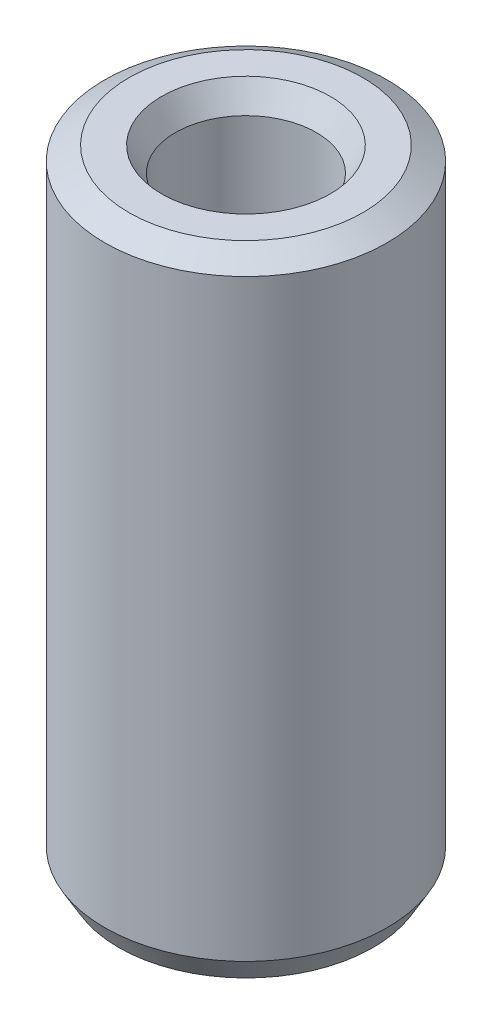
ISO-10303-21;
HEADER;
FILE_DESCRIPTION(('STEP AP214'),'2;1');
FILE_NAME('part.step','',(''),(''),'','','');
FILE_SCHEMA(('AUTOMOTIVE_DESIGN { 1 0 10303 214 1 1 1 1 }'));
ENDSEC;
DATA;
#1=APPLICATION_CONTEXT('core data for automotive mechanical design processes');
#2=APPLICATION_PROTOCOL_DEFINITION('international standard','automotive_design',2000,#1);
#3=PRODUCT_CONTEXT('',#1,'mechanical');
#4=PRODUCT('Part','Part','',(#3));
#5=PRODUCT_RELATED_PRODUCT_CATEGORY('part','',(#4));
#6=PRODUCT_DEFINITION_FORMATION('','',#4);
#7=PRODUCT_DEFINITION_CONTEXT('part definition',#1,'design');
#8=PRODUCT_DEFINITION('design','',#6,#7);
#9=PRODUCT_DEFINITION_SHAPE('','',#8);
#10=(LENGTH_UNIT() NAMED_UNIT(*) SI_UNIT(.MILLI.,.METRE.));
#11=(NAMED_UNIT(*) PLANE_ANGLE_UNIT() SI_UNIT($,.RADIAN.));
#12=(NAMED_UNIT(*) SI_UNIT($,.STERADIAN.) SOLID_ANGLE_UNIT());
#13=UNCERTAINTY_MEASURE_WITH_UNIT(LENGTH_MEASURE(1.E-05),#10,'distance_accuracy_value','');
#14=(GEOMETRIC_REPRESENTATION_CONTEXT(3) GLOBAL_UNCERTAINTY_ASSIGNED_CONTEXT((#13)) GLOBAL_UNIT_ASSIGNED_CONTEXT((#10,
#11,#12)) REPRESENTATION_CONTEXT('',''));
#15=CARTESIAN_POINT('',(0.,0.,0.));
#16=DIRECTION('',(0.,0.,1.));
#17=DIRECTION('',(1.,0.,0.));
#18=AXIS2_PLACEMENT_3D('',#15,#16,#17);
#19=CARTESIAN_POINT('',(0.,55.8873489757776,0.));
#20=DIRECTION('',(0.,-1.,0.));
#21=DIRECTION('',(0.,0.,-1.));
#22=AXIS2_PLACEMENT_3D('',#19,#20,#21);
#23=CYLINDRICAL_SURFACE('',#22,12.5);
#24=CARTESIAN_POINT('',(0.,2.14613170068918,0.));
#25=DIRECTION('',(0.,1.,0.));
#26=DIRECTION('',(0.,0.,1.));
#27=AXIS2_PLACEMENT_3D('',#24,#25,#26);
#28=CIRCLE('',#27,12.5);
#29=CARTESIAN_POINT('',(0.,2.14613170068918,12.5));
#30=VERTEX_POINT('',#29);
#31=EDGE_CURVE('E10',#30,#30,#28,.T.);
#32=ORIENTED_EDGE('',*,*,#31,.T.);
#33=EDGE_LOOP('',(#32));
#34=FACE_BOUND('',#33,.T.);
#35=CARTESIAN_POINT('',(0.,54.6482792606683,0.));
#36=DIRECTION('',(0.,1.,0.));
#37=DIRECTION('',(0.,0.,1.));
#38=AXIS2_PLACEMENT_3D('',#35,#36,#37);
#39=CIRCLE('',#38,12.5);
#40=CARTESIAN_POINT('',(0.,54.6482792606683,12.5));
#41=VERTEX_POINT('',#40);
#42=EDGE_CURVE('E50',#41,#41,#39,.F.);
#43=ORIENTED_EDGE('',*,*,#42,.T.);
#44=EDGE_LOOP('',(#43));
#45=FACE_BOUND('',#44,.T.);
#46=ADVANCED_FACE('F39',(#34,#45),#23,.T.);
#47=CARTESIAN_POINT('',(0.,55.8873489757776,0.));
#48=DIRECTION('',(0.,1.,0.));
#49=DIRECTION('',(0.,0.,1.));
#50=AXIS2_PLACEMENT_3D('',#47,#48,#49);
#51=PLANE('',#50);
#52=CARTESIAN_POINT('',(0.,55.8873489757776,0.));
#53=DIRECTION('',(0.,1.,0.));
#54=DIRECTION('',(0.,0.,1.));
#55=AXIS2_PLACEMENT_3D('',#52,#53,#54);
#56=CIRCLE('',#55,7.47347615860056);
#57=CARTESIAN_POINT('',(0.,55.8873489757776,7.47347615860056));
#58=VERTEX_POINT('',#57);
#59=EDGE_CURVE('E58',#58,#58,#56,.F.);
#60=ORIENTED_EDGE('',*,*,#59,.T.);
#61=EDGE_LOOP('',(#60));
#62=FACE_BOUND('',#61,.T.);
#63=CARTESIAN_POINT('',(0.,55.8873489757776,0.));
#64=DIRECTION('',(0.,1.,0.));
#65=DIRECTION('',(0.,0.,1.));
#66=AXIS2_PLACEMENT_3D('',#63,#64,#65);
#67=CIRCLE('',#66,10.3538682993108);
#68=CARTESIAN_POINT('',(0.,55.8873489757776,10.3538682993108));
#69=VERTEX_POINT('',#68);
#70=EDGE_CURVE('E61',#69,#69,#67,.T.);
#71=ORIENTED_EDGE('',*,*,#70,.T.);
#72=EDGE_LOOP('',(#71));
#73=FACE_BOUND('',#72,.T.);
#74=ADVANCED_FACE('F88',(#62,#73),#51,.T.);
#75=CARTESIAN_POINT('',(0.,0.,0.));
#76=DIRECTION('',(0.,1.,0.));
#77=DIRECTION('',(0.,0.,1.));
#78=AXIS2_PLACEMENT_3D('',#75,#76,#77);
#79=PLANE('',#78);
#80=CARTESIAN_POINT('',(0.,0.,0.));
#81=DIRECTION('',(0.,1.,0.));
#82=DIRECTION('',(0.,0.,1.));
#83=AXIS2_PLACEMENT_3D('',#80,#81,#82);
#84=CIRCLE('',#83,8.38053814418046);
#85=CARTESIAN_POINT('',(0.,0.,8.38053814418046));
#86=VERTEX_POINT('',#85);
#87=EDGE_CURVE('E51',#86,#86,#84,.T.);
#88=ORIENTED_EDGE('',*,*,#87,.T.);
#89=EDGE_LOOP('',(#88));
#90=FACE_BOUND('',#89,.T.);
#91=CARTESIAN_POINT('',(0.,0.,0.));
#92=DIRECTION('',(0.,1.,0.));
#93=DIRECTION('',(0.,0.,1.));
#94=AXIS2_PLACEMENT_3D('',#91,#92,#93);
#95=CIRCLE('',#94,11.2609302848907);
#96=CARTESIAN_POINT('',(0.,0.,11.2609302848907));
#97=VERTEX_POINT('',#96);
#98=EDGE_CURVE('E54',#97,#97,#95,.F.);
#99=ORIENTED_EDGE('',*,*,#98,.T.);
#100=EDGE_LOOP('',(#99));
#101=FACE_BOUND('',#100,.T.);
#102=ADVANCED_FACE('F83',(#90,#101),#79,.F.);
#103=CARTESIAN_POINT('',(0.,55.8873489757776,0.));
#104=DIRECTION('',(0.,-1.,0.));
#105=DIRECTION('',(0.,0.,-1.));
#106=AXIS2_PLACEMENT_3D('',#103,#104,#105);
#107=CYLINDRICAL_SURFACE('',#106,6.23440644349126);
#108=CARTESIAN_POINT('',(0.,53.7412172750884,0.));
#109=DIRECTION('',(0.,1.,0.));
#110=DIRECTION('',(0.,0.,1.));
#111=AXIS2_PLACEMENT_3D('',#108,#109,#110);
#112=CIRCLE('',#111,6.23440644349126);
#113=CARTESIAN_POINT('',(0.,53.7412172750884,6.23440644349126));
#114=VERTEX_POINT('',#113);
#115=EDGE_CURVE('E67',#114,#114,#112,.T.);
#116=ORIENTED_EDGE('',*,*,#115,.T.);
#117=EDGE_LOOP('',(#116));
#118=FACE_BOUND('',#117,.T.);
#119=CARTESIAN_POINT('',(0.,1.23906971510931,0.));
#120=DIRECTION('',(0.,1.,0.));
#121=DIRECTION('',(0.,0.,1.));
#122=AXIS2_PLACEMENT_3D('',#119,#120,#121);
#123=CIRCLE('',#122,6.23440644349126);
#124=CARTESIAN_POINT('',(0.,1.23906971510931,6.23440644349126));
#125=VERTEX_POINT('',#124);
#126=EDGE_CURVE('E69',#125,#125,#123,.F.);
#127=ORIENTED_EDGE('',*,*,#126,.T.);
#128=EDGE_LOOP('',(#127));
#129=FACE_BOUND('',#128,.T.);
#130=ADVANCED_FACE('F71',(#118,#129),#107,.F.);
#131=CARTESIAN_POINT('',(0.,53.7412172750884,0.));
#132=DIRECTION('',(0.,1.,0.));
#133=DIRECTION('',(0.,0.,1.));
#134=AXIS2_PLACEMENT_3D('',#131,#132,#133);
#135=CONICAL_SURFACE('',#134,6.23440644349126,0.523598775598302);
#136=ORIENTED_EDGE('',*,*,#59,.F.);
#137=EDGE_LOOP('',(#136));
#138=FACE_BOUND('',#137,.T.);
#139=ORIENTED_EDGE('',*,*,#115,.F.);
#140=EDGE_LOOP('',(#139));
#141=FACE_BOUND('',#140,.T.);
#142=ADVANCED_FACE('F77',(#138,#141),#135,.F.);
#143=CARTESIAN_POINT('',(0.,0.,0.));
#144=DIRECTION('',(0.,-1.,0.));
#145=DIRECTION('',(0.,0.,-1.));
#146=AXIS2_PLACEMENT_3D('',#143,#144,#145);
#147=CONICAL_SURFACE('',#146,8.38053814418046,1.04719755119659);
#148=ORIENTED_EDGE('',*,*,#126,.F.);
#149=EDGE_LOOP('',(#148));
#150=FACE_BOUND('',#149,.T.);
#151=ORIENTED_EDGE('',*,*,#87,.F.);
#152=EDGE_LOOP('',(#151));
#153=FACE_BOUND('',#152,.T.);
#154=ADVANCED_FACE('F73',(#150,#153),#147,.F.);
#155=CARTESIAN_POINT('',(0.,2.14613170068918,0.));
#156=DIRECTION('',(0.,1.,0.));
#157=DIRECTION('',(0.,0.,1.));
#158=AXIS2_PLACEMENT_3D('',#155,#156,#157);
#159=CONICAL_SURFACE('',#158,12.5,0.523598775598303);
#160=ORIENTED_EDGE('',*,*,#98,.F.);
#161=EDGE_LOOP('',(#160));
#162=FACE_BOUND('',#161,.T.);
#163=ORIENTED_EDGE('',*,*,#31,.F.);
#164=EDGE_LOOP('',(#163));
#165=FACE_BOUND('',#164,.T.);
#166=ADVANCED_FACE('F76',(#162,#165),#159,.T.);
#167=CARTESIAN_POINT('',(0.,55.8873489757776,0.));
#168=DIRECTION('',(0.,-1.,0.));
#169=DIRECTION('',(0.,0.,-1.));
#170=AXIS2_PLACEMENT_3D('',#167,#168,#169);
#171=CONICAL_SURFACE('',#170,10.3538682993108,1.04719755119659);
#172=ORIENTED_EDGE('',*,*,#42,.F.);
#173=EDGE_LOOP('',(#172));
#174=FACE_BOUND('',#173,.T.);
#175=ORIENTED_EDGE('',*,*,#70,.F.);
#176=EDGE_LOOP('',(#175));
#177=FACE_BOUND('',#176,.T.);
#178=ADVANCED_FACE('F45',(#174,#177),#171,.T.);
#179=CLOSED_SHELL('',(#46,#74,#102,#130,#142,#154,#166,#178));
#180=MANIFOLD_SOLID_BREP('B2',#179);
#181=ADVANCED_BREP_SHAPE_REPRESENTATION('',(#18,#180),#14);
#182=SHAPE_DEFINITION_REPRESENTATION(#9,#181);
ENDSEC;
END-ISO-10303-21;
